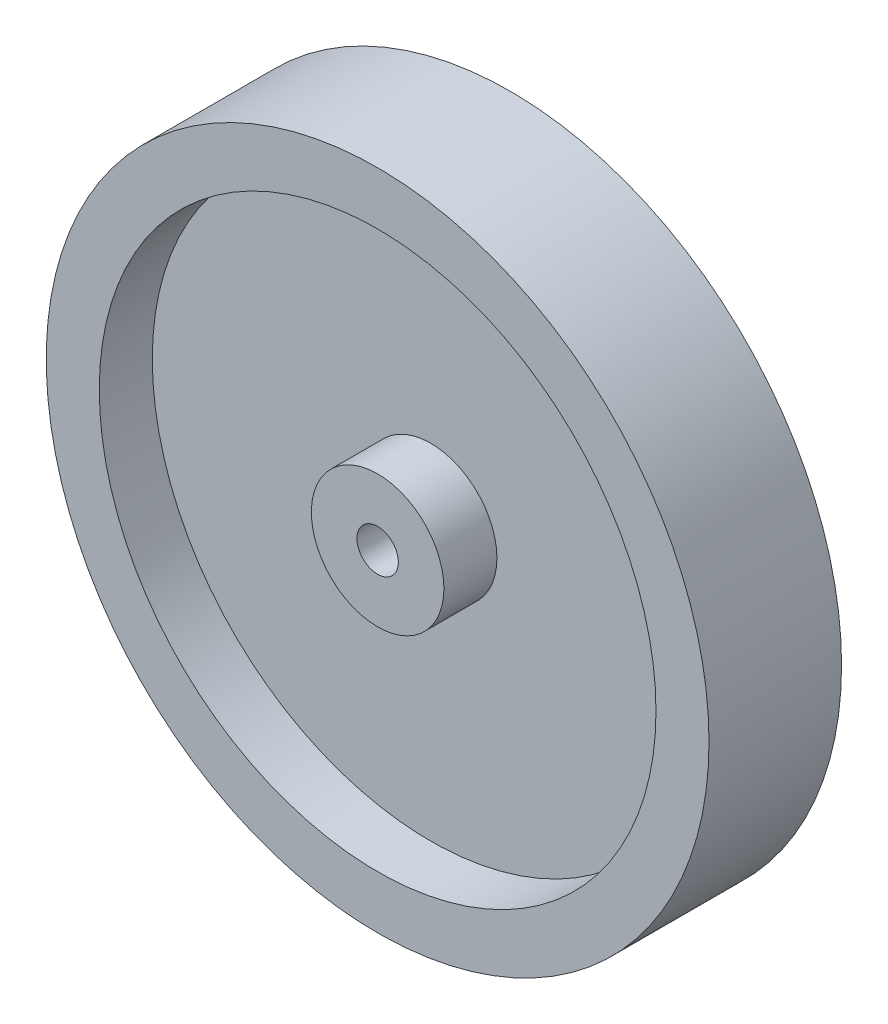
ISO-10303-21;
HEADER;
FILE_DESCRIPTION(('STEP AP214'),'2;1');
FILE_NAME('part.step','',(''),(''),'','','');
FILE_SCHEMA(('AUTOMOTIVE_DESIGN { 1 0 10303 214 1 1 1 1 }'));
ENDSEC;
DATA;
#1=APPLICATION_CONTEXT('core data for automotive mechanical design processes');
#2=APPLICATION_PROTOCOL_DEFINITION('international standard','automotive_design',2000,#1);
#3=PRODUCT_CONTEXT('',#1,'mechanical');
#4=PRODUCT('Part','Part','',(#3));
#5=PRODUCT_RELATED_PRODUCT_CATEGORY('part','',(#4));
#6=PRODUCT_DEFINITION_FORMATION('','',#4);
#7=PRODUCT_DEFINITION_CONTEXT('part definition',#1,'design');
#8=PRODUCT_DEFINITION('design','',#6,#7);
#9=PRODUCT_DEFINITION_SHAPE('','',#8);
#10=(LENGTH_UNIT() NAMED_UNIT(*) SI_UNIT(.MILLI.,.METRE.));
#11=(NAMED_UNIT(*) PLANE_ANGLE_UNIT() SI_UNIT($,.RADIAN.));
#12=(NAMED_UNIT(*) SI_UNIT($,.STERADIAN.) SOLID_ANGLE_UNIT());
#13=UNCERTAINTY_MEASURE_WITH_UNIT(LENGTH_MEASURE(1.E-05),#10,'distance_accuracy_value','');
#14=(GEOMETRIC_REPRESENTATION_CONTEXT(3) GLOBAL_UNCERTAINTY_ASSIGNED_CONTEXT((#13)) GLOBAL_UNIT_ASSIGNED_CONTEXT((#10,
#11,#12)) REPRESENTATION_CONTEXT('',''));
#15=CARTESIAN_POINT('',(0.,0.,0.));
#16=DIRECTION('',(0.,0.,1.));
#17=DIRECTION('',(1.,0.,0.));
#18=AXIS2_PLACEMENT_3D('',#15,#16,#17);
#19=CARTESIAN_POINT('',(0.,0.,-12.7));
#20=DIRECTION('',(0.,0.,1.));
#21=DIRECTION('',(1.,0.,0.));
#22=AXIS2_PLACEMENT_3D('',#19,#20,#21);
#23=PLANE('',#22);
#24=CARTESIAN_POINT('',(0.,0.,-12.7));
#25=DIRECTION('',(0.,0.,1.));
#26=DIRECTION('',(1.,0.,0.));
#27=AXIS2_PLACEMENT_3D('',#24,#25,#26);
#28=CIRCLE('',#27,3.96875);
#29=CARTESIAN_POINT('',(3.96875,0.,-12.7));
#30=VERTEX_POINT('',#29);
#31=EDGE_CURVE('E53',#30,#30,#28,.T.);
#32=ORIENTED_EDGE('',*,*,#31,.T.);
#33=EDGE_LOOP('',(#32));
#34=FACE_BOUND('',#33,.T.);
#35=CARTESIAN_POINT('',(0.,0.,-12.7));
#36=DIRECTION('',(0.,0.,1.));
#37=DIRECTION('',(1.,0.,0.));
#38=AXIS2_PLACEMENT_3D('',#35,#36,#37);
#39=CIRCLE('',#38,12.7);
#40=CARTESIAN_POINT('',(12.7,0.,-12.7));
#41=VERTEX_POINT('',#40);
#42=EDGE_CURVE('E85',#41,#41,#39,.T.);
#43=ORIENTED_EDGE('',*,*,#42,.F.);
#44=EDGE_LOOP('',(#43));
#45=FACE_BOUND('',#44,.T.);
#46=ADVANCED_FACE('F38',(#34,#45),#23,.F.);
#47=CARTESIAN_POINT('',(0.,0.,12.7));
#48=DIRECTION('',(0.,0.,1.));
#49=DIRECTION('',(1.,0.,0.));
#50=AXIS2_PLACEMENT_3D('',#47,#48,#49);
#51=PLANE('',#50);
#52=CARTESIAN_POINT('',(0.,0.,12.7));
#53=DIRECTION('',(0.,0.,1.));
#54=DIRECTION('',(1.,0.,0.));
#55=AXIS2_PLACEMENT_3D('',#52,#53,#54);
#56=CIRCLE('',#55,3.96875);
#57=CARTESIAN_POINT('',(3.96875,0.,12.7));
#58=VERTEX_POINT('',#57);
#59=EDGE_CURVE('E55',#58,#58,#56,.T.);
#60=ORIENTED_EDGE('',*,*,#59,.F.);
#61=EDGE_LOOP('',(#60));
#62=FACE_BOUND('',#61,.T.);
#63=CARTESIAN_POINT('',(0.,0.,12.7));
#64=DIRECTION('',(0.,0.,1.));
#65=DIRECTION('',(1.,0.,0.));
#66=AXIS2_PLACEMENT_3D('',#63,#64,#65);
#67=CIRCLE('',#66,12.7);
#68=CARTESIAN_POINT('',(12.7,0.,12.7));
#69=VERTEX_POINT('',#68);
#70=EDGE_CURVE('E69',#69,#69,#67,.T.);
#71=ORIENTED_EDGE('',*,*,#70,.T.);
#72=EDGE_LOOP('',(#71));
#73=FACE_BOUND('',#72,.T.);
#74=ADVANCED_FACE('F103',(#62,#73),#51,.T.);
#75=CARTESIAN_POINT('',(0.,0.,-12.7));
#76=DIRECTION('',(0.,0.,1.));
#77=DIRECTION('',(1.,0.,0.));
#78=AXIS2_PLACEMENT_3D('',#75,#76,#77);
#79=CYLINDRICAL_SURFACE('',#78,63.5);
#80=CARTESIAN_POINT('',(0.,0.,-12.7));
#81=DIRECTION('',(0.,0.,1.));
#82=DIRECTION('',(1.,0.,0.));
#83=AXIS2_PLACEMENT_3D('',#80,#81,#82);
#84=CIRCLE('',#83,63.5);
#85=CARTESIAN_POINT('',(63.5,0.,-12.7));
#86=VERTEX_POINT('',#85);
#87=EDGE_CURVE('E10',#86,#86,#84,.T.);
#88=ORIENTED_EDGE('',*,*,#87,.T.);
#89=EDGE_LOOP('',(#88));
#90=FACE_BOUND('',#89,.T.);
#91=CARTESIAN_POINT('',(0.,0.,12.7));
#92=DIRECTION('',(0.,0.,1.));
#93=DIRECTION('',(1.,0.,0.));
#94=AXIS2_PLACEMENT_3D('',#91,#92,#93);
#95=CIRCLE('',#94,63.5);
#96=CARTESIAN_POINT('',(63.5,0.,12.7));
#97=VERTEX_POINT('',#96);
#98=EDGE_CURVE('E42',#97,#97,#95,.T.);
#99=ORIENTED_EDGE('',*,*,#98,.F.);
#100=EDGE_LOOP('',(#99));
#101=FACE_BOUND('',#100,.T.);
#102=ADVANCED_FACE('F40',(#90,#101),#79,.T.);
#103=CARTESIAN_POINT('',(0.,0.,-12.7));
#104=DIRECTION('',(0.,0.,1.));
#105=DIRECTION('',(1.,0.,0.));
#106=AXIS2_PLACEMENT_3D('',#103,#104,#105);
#107=CIRCLE('',#106,53.34);
#108=CARTESIAN_POINT('',(53.34,0.,-12.7));
#109=VERTEX_POINT('',#108);
#110=EDGE_CURVE('E77',#109,#109,#107,.T.);
#111=ORIENTED_EDGE('',*,*,#110,.T.);
#112=EDGE_LOOP('',(#111));
#113=FACE_BOUND('',#112,.T.);
#114=ORIENTED_EDGE('',*,*,#87,.F.);
#115=EDGE_LOOP('',(#114));
#116=FACE_BOUND('',#115,.T.);
#117=ADVANCED_FACE('F106',(#113,#116),#23,.F.);
#118=CARTESIAN_POINT('',(0.,0.,12.7));
#119=DIRECTION('',(0.,0.,1.));
#120=DIRECTION('',(1.,0.,0.));
#121=AXIS2_PLACEMENT_3D('',#118,#119,#120);
#122=CIRCLE('',#121,53.34);
#123=CARTESIAN_POINT('',(53.34,0.,12.7));
#124=VERTEX_POINT('',#123);
#125=EDGE_CURVE('E63',#124,#124,#122,.T.);
#126=ORIENTED_EDGE('',*,*,#125,.F.);
#127=EDGE_LOOP('',(#126));
#128=FACE_BOUND('',#127,.T.);
#129=ORIENTED_EDGE('',*,*,#98,.T.);
#130=EDGE_LOOP('',(#129));
#131=FACE_BOUND('',#130,.T.);
#132=ADVANCED_FACE('F111',(#128,#131),#51,.T.);
#133=CARTESIAN_POINT('',(0.,0.,-12.7));
#134=DIRECTION('',(0.,0.,1.));
#135=DIRECTION('',(1.,0.,0.));
#136=AXIS2_PLACEMENT_3D('',#133,#134,#135);
#137=CYLINDRICAL_SURFACE('',#136,3.96875);
#138=ORIENTED_EDGE('',*,*,#31,.F.);
#139=EDGE_LOOP('',(#138));
#140=FACE_BOUND('',#139,.T.);
#141=ORIENTED_EDGE('',*,*,#59,.T.);
#142=EDGE_LOOP('',(#141));
#143=FACE_BOUND('',#142,.T.);
#144=ADVANCED_FACE('F119',(#140,#143),#137,.F.);
#145=CARTESIAN_POINT('',(0.,0.,2.54));
#146=DIRECTION('',(0.,0.,1.));
#147=DIRECTION('',(1.,0.,0.));
#148=AXIS2_PLACEMENT_3D('',#145,#146,#147);
#149=CYLINDRICAL_SURFACE('',#148,53.34);
#150=CARTESIAN_POINT('',(0.,0.,2.54));
#151=DIRECTION('',(0.,0.,1.));
#152=DIRECTION('',(1.,0.,0.));
#153=AXIS2_PLACEMENT_3D('',#150,#151,#152);
#154=CIRCLE('',#153,53.34);
#155=CARTESIAN_POINT('',(53.34,0.,2.54));
#156=VERTEX_POINT('',#155);
#157=EDGE_CURVE('E59',#156,#156,#154,.T.);
#158=ORIENTED_EDGE('',*,*,#157,.F.);
#159=EDGE_LOOP('',(#158));
#160=FACE_BOUND('',#159,.T.);
#161=ORIENTED_EDGE('',*,*,#125,.T.);
#162=EDGE_LOOP('',(#161));
#163=FACE_BOUND('',#162,.T.);
#164=ADVANCED_FACE('F140',(#160,#163),#149,.F.);
#165=CARTESIAN_POINT('',(0.,0.,2.54));
#166=DIRECTION('',(0.,0.,1.));
#167=DIRECTION('',(1.,0.,0.));
#168=AXIS2_PLACEMENT_3D('',#165,#166,#167);
#169=PLANE('',#168);
#170=CARTESIAN_POINT('',(0.,0.,2.54));
#171=DIRECTION('',(0.,0.,1.));
#172=DIRECTION('',(1.,0.,0.));
#173=AXIS2_PLACEMENT_3D('',#170,#171,#172);
#174=CIRCLE('',#173,12.7);
#175=CARTESIAN_POINT('',(12.7,0.,2.54));
#176=VERTEX_POINT('',#175);
#177=EDGE_CURVE('E66',#176,#176,#174,.T.);
#178=ORIENTED_EDGE('',*,*,#177,.F.);
#179=EDGE_LOOP('',(#178));
#180=FACE_BOUND('',#179,.T.);
#181=ORIENTED_EDGE('',*,*,#157,.T.);
#182=EDGE_LOOP('',(#181));
#183=FACE_BOUND('',#182,.T.);
#184=ADVANCED_FACE('F136',(#180,#183),#169,.T.);
#185=CARTESIAN_POINT('',(0.,0.,2.54));
#186=DIRECTION('',(0.,0.,1.));
#187=DIRECTION('',(1.,0.,0.));
#188=AXIS2_PLACEMENT_3D('',#185,#186,#187);
#189=CYLINDRICAL_SURFACE('',#188,12.7);
#190=ORIENTED_EDGE('',*,*,#177,.T.);
#191=EDGE_LOOP('',(#190));
#192=FACE_BOUND('',#191,.T.);
#193=ORIENTED_EDGE('',*,*,#70,.F.);
#194=EDGE_LOOP('',(#193));
#195=FACE_BOUND('',#194,.T.);
#196=ADVANCED_FACE('F130',(#192,#195),#189,.T.);
#197=CARTESIAN_POINT('',(0.,0.,-2.54));
#198=DIRECTION('',(0.,0.,-1.));
#199=DIRECTION('',(1.,0.,0.));
#200=AXIS2_PLACEMENT_3D('',#197,#198,#199);
#201=PLANE('',#200);
#202=CARTESIAN_POINT('',(0.,0.,-2.54));
#203=DIRECTION('',(0.,0.,1.));
#204=DIRECTION('',(1.,0.,0.));
#205=AXIS2_PLACEMENT_3D('',#202,#203,#204);
#206=CIRCLE('',#205,53.34);
#207=CARTESIAN_POINT('',(53.34,0.,-2.54));
#208=VERTEX_POINT('',#207);
#209=EDGE_CURVE('E73',#208,#208,#206,.T.);
#210=ORIENTED_EDGE('',*,*,#209,.F.);
#211=EDGE_LOOP('',(#210));
#212=FACE_BOUND('',#211,.T.);
#213=CARTESIAN_POINT('',(0.,0.,-2.54));
#214=DIRECTION('',(0.,0.,1.));
#215=DIRECTION('',(1.,0.,0.));
#216=AXIS2_PLACEMENT_3D('',#213,#214,#215);
#217=CIRCLE('',#216,12.7);
#218=CARTESIAN_POINT('',(12.7,0.,-2.54));
#219=VERTEX_POINT('',#218);
#220=EDGE_CURVE('E81',#219,#219,#217,.T.);
#221=ORIENTED_EDGE('',*,*,#220,.T.);
#222=EDGE_LOOP('',(#221));
#223=FACE_BOUND('',#222,.T.);
#224=ADVANCED_FACE('F93',(#212,#223),#201,.T.);
#225=CARTESIAN_POINT('',(0.,0.,-2.54));
#226=DIRECTION('',(0.,0.,-1.));
#227=DIRECTION('',(-1.,0.,0.));
#228=AXIS2_PLACEMENT_3D('',#225,#226,#227);
#229=CYLINDRICAL_SURFACE('',#228,53.34);
#230=ORIENTED_EDGE('',*,*,#209,.T.);
#231=EDGE_LOOP('',(#230));
#232=FACE_BOUND('',#231,.T.);
#233=ORIENTED_EDGE('',*,*,#110,.F.);
#234=EDGE_LOOP('',(#233));
#235=FACE_BOUND('',#234,.T.);
#236=ADVANCED_FACE('F98',(#232,#235),#229,.F.);
#237=CARTESIAN_POINT('',(0.,0.,-2.54));
#238=DIRECTION('',(0.,0.,-1.));
#239=DIRECTION('',(-1.,0.,0.));
#240=AXIS2_PLACEMENT_3D('',#237,#238,#239);
#241=CYLINDRICAL_SURFACE('',#240,12.7);
#242=ORIENTED_EDGE('',*,*,#220,.F.);
#243=EDGE_LOOP('',(#242));
#244=FACE_BOUND('',#243,.T.);
#245=ORIENTED_EDGE('',*,*,#42,.T.);
#246=EDGE_LOOP('',(#245));
#247=FACE_BOUND('',#246,.T.);
#248=ADVANCED_FACE('F95',(#244,#247),#241,.T.);
#249=CLOSED_SHELL('',(#46,#74,#102,#117,#132,#144,#164,#184,#196,#224,#236,#248));
#250=MANIFOLD_SOLID_BREP('B2',#249);
#251=ADVANCED_BREP_SHAPE_REPRESENTATION('',(#18,#250),#14);
#252=SHAPE_DEFINITION_REPRESENTATION(#9,#251);
ENDSEC;
END-ISO-10303-21;
